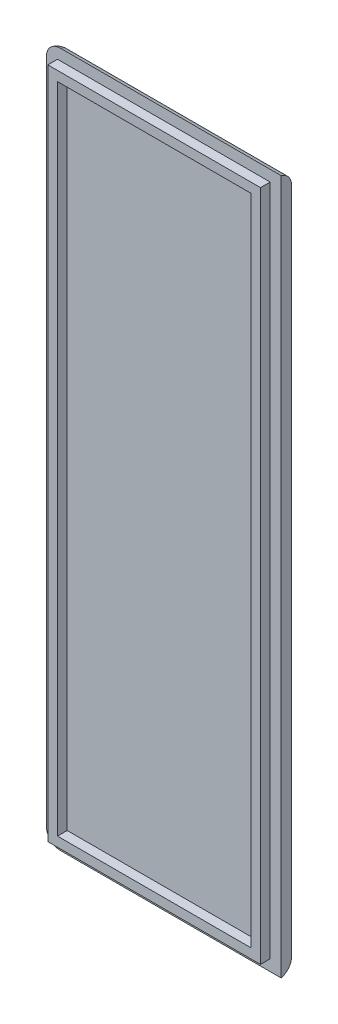
ISO-10303-21;
HEADER;
FILE_DESCRIPTION(('STEP AP214'),'2;1');
FILE_NAME('part.step','',(''),(''),'','','');
FILE_SCHEMA(('AUTOMOTIVE_DESIGN { 1 0 10303 214 1 1 1 1 }'));
ENDSEC;
DATA;
#1=APPLICATION_CONTEXT('core data for automotive mechanical design processes');
#2=APPLICATION_PROTOCOL_DEFINITION('international standard','automotive_design',2000,#1);
#3=PRODUCT_CONTEXT('',#1,'mechanical');
#4=PRODUCT('Part','Part','',(#3));
#5=PRODUCT_RELATED_PRODUCT_CATEGORY('part','',(#4));
#6=PRODUCT_DEFINITION_FORMATION('','',#4);
#7=PRODUCT_DEFINITION_CONTEXT('part definition',#1,'design');
#8=PRODUCT_DEFINITION('design','',#6,#7);
#9=PRODUCT_DEFINITION_SHAPE('','',#8);
#10=(LENGTH_UNIT() NAMED_UNIT(*) SI_UNIT(.MILLI.,.METRE.));
#11=(NAMED_UNIT(*) PLANE_ANGLE_UNIT() SI_UNIT($,.RADIAN.));
#12=(NAMED_UNIT(*) SI_UNIT($,.STERADIAN.) SOLID_ANGLE_UNIT());
#13=UNCERTAINTY_MEASURE_WITH_UNIT(LENGTH_MEASURE(1.E-05),#10,'distance_accuracy_value','');
#14=(GEOMETRIC_REPRESENTATION_CONTEXT(3) GLOBAL_UNCERTAINTY_ASSIGNED_CONTEXT((#13)) GLOBAL_UNIT_ASSIGNED_CONTEXT((#10,
#11,#12)) REPRESENTATION_CONTEXT('',''));
#15=CARTESIAN_POINT('',(0.,0.,0.));
#16=DIRECTION('',(0.,0.,1.));
#17=DIRECTION('',(1.,0.,0.));
#18=AXIS2_PLACEMENT_3D('',#15,#16,#17);
#19=CARTESIAN_POINT('',(0.,0.,1.5));
#20=DIRECTION('',(0.,0.,-1.));
#21=DIRECTION('',(-1.,0.,0.));
#22=AXIS2_PLACEMENT_3D('',#19,#20,#21);
#23=PLANE('',#22);
#24=DIRECTION('',(-1.,0.,0.));
#25=VECTOR('',#24,1.);
#26=CARTESIAN_POINT('',(0.,100.65,1.5));
#27=LINE('',#26,#25);
#28=CARTESIAN_POINT('',(34.,100.65,1.5));
#29=VERTEX_POINT('',#28);
#30=CARTESIAN_POINT('',(1.99999999999998,100.65,1.5));
#31=VERTEX_POINT('',#30);
#32=EDGE_CURVE('E219',#29,#31,#27,.T.);
#33=ORIENTED_EDGE('',*,*,#32,.T.);
#34=CARTESIAN_POINT('',(1.99999999999998,98.65,1.5));
#35=DIRECTION('',(0.,0.,-1.));
#36=DIRECTION('',(-1.,0.,0.));
#37=AXIS2_PLACEMENT_3D('',#34,#35,#36);
#38=CIRCLE('',#37,2.);
#39=CARTESIAN_POINT('',(0.,98.65,1.5));
#40=VERTEX_POINT('',#39);
#41=EDGE_CURVE('E226',#31,#40,#38,.F.);
#42=ORIENTED_EDGE('',*,*,#41,.T.);
#43=DIRECTION('',(0.,-1.,0.));
#44=VECTOR('',#43,1.);
#45=CARTESIAN_POINT('',(0.,0.,1.5));
#46=LINE('',#45,#44);
#47=CARTESIAN_POINT('',(0.,2.,1.5));
#48=VERTEX_POINT('',#47);
#49=EDGE_CURVE('E212',#40,#48,#46,.T.);
#50=ORIENTED_EDGE('',*,*,#49,.T.);
#51=CARTESIAN_POINT('',(2.,2.,1.5));
#52=DIRECTION('',(0.,0.,-1.));
#53=DIRECTION('',(-1.,0.,0.));
#54=AXIS2_PLACEMENT_3D('',#51,#52,#53);
#55=CIRCLE('',#54,2.);
#56=CARTESIAN_POINT('',(2.,0.,1.5));
#57=VERTEX_POINT('',#56);
#58=EDGE_CURVE('E222',#48,#57,#55,.F.);
#59=ORIENTED_EDGE('',*,*,#58,.T.);
#60=DIRECTION('',(1.,0.,0.));
#61=VECTOR('',#60,1.);
#62=CARTESIAN_POINT('',(0.,0.,1.5));
#63=LINE('',#62,#61);
#64=CARTESIAN_POINT('',(34.,0.,1.5));
#65=VERTEX_POINT('',#64);
#66=EDGE_CURVE('E214',#57,#65,#63,.T.);
#67=ORIENTED_EDGE('',*,*,#66,.T.);
#68=DIRECTION('',(0.,1.,0.));
#69=VECTOR('',#68,1.);
#70=CARTESIAN_POINT('',(34.,0.,1.5));
#71=LINE('',#70,#69);
#72=EDGE_CURVE('E216',#65,#29,#71,.T.);
#73=ORIENTED_EDGE('',*,*,#72,.T.);
#74=EDGE_LOOP('',(#33,#42,#50,#59,#67,#73));
#75=FACE_BOUND('',#74,.T.);
#76=DIRECTION('',(0.,-1.,0.));
#77=VECTOR('',#76,1.);
#78=CARTESIAN_POINT('',(1.59999999999998,99.05,1.5));
#79=LINE('',#78,#77);
#80=CARTESIAN_POINT('',(1.59999999999998,99.05,1.5));
#81=VERTEX_POINT('',#80);
#82=CARTESIAN_POINT('',(1.59999999999999,1.6,1.5));
#83=VERTEX_POINT('',#82);
#84=EDGE_CURVE('E155',#81,#83,#79,.T.);
#85=ORIENTED_EDGE('',*,*,#84,.F.);
#86=DIRECTION('',(-1.,0.,0.));
#87=VECTOR('',#86,1.);
#88=CARTESIAN_POINT('',(1.59999999999998,99.05,1.5));
#89=LINE('',#88,#87);
#90=CARTESIAN_POINT('',(32.4,99.05,1.5));
#91=VERTEX_POINT('',#90);
#92=EDGE_CURVE('E183',#91,#81,#89,.T.);
#93=ORIENTED_EDGE('',*,*,#92,.F.);
#94=DIRECTION('',(0.,1.,0.));
#95=VECTOR('',#94,1.);
#96=CARTESIAN_POINT('',(32.4,99.05,1.5));
#97=LINE('',#96,#95);
#98=CARTESIAN_POINT('',(32.4,1.6,1.5));
#99=VERTEX_POINT('',#98);
#100=EDGE_CURVE('E195',#99,#91,#97,.T.);
#101=ORIENTED_EDGE('',*,*,#100,.F.);
#102=DIRECTION('',(1.,0.,0.));
#103=VECTOR('',#102,1.);
#104=CARTESIAN_POINT('',(1.59999999999999,1.6,1.5));
#105=LINE('',#104,#103);
#106=EDGE_CURVE('E192',#83,#99,#105,.T.);
#107=ORIENTED_EDGE('',*,*,#106,.F.);
#108=EDGE_LOOP('',(#85,#93,#101,#107));
#109=FACE_BOUND('',#108,.T.);
#110=ADVANCED_FACE('F35',(#75,#109),#23,.F.);
#111=CARTESIAN_POINT('',(34.,0.,1.5));
#112=DIRECTION('',(-1.,0.,0.));
#113=DIRECTION('',(0.,-1.,0.));
#114=AXIS2_PLACEMENT_3D('',#111,#112,#113);
#115=PLANE('',#114);
#116=DIRECTION('',(0.,1.,0.));
#117=VECTOR('',#116,1.);
#118=CARTESIAN_POINT('',(34.,0.,0.));
#119=LINE('',#118,#117);
#120=CARTESIAN_POINT('',(34.,1.93649167310371,0.));
#121=VERTEX_POINT('',#120);
#122=CARTESIAN_POINT('',(34.,98.7135083268963,0.));
#123=VERTEX_POINT('',#122);
#124=EDGE_CURVE('E211',#121,#123,#119,.T.);
#125=ORIENTED_EDGE('',*,*,#124,.T.);
#126=CARTESIAN_POINT('',(34.,98.7135083268963,2.));
#127=DIRECTION('',(-1.,0.,0.));
#128=DIRECTION('',(0.,-1.,0.));
#129=AXIS2_PLACEMENT_3D('',#126,#127,#128);
#130=CIRCLE('',#129,2.);
#131=EDGE_CURVE('E11',#123,#29,#130,.F.);
#132=ORIENTED_EDGE('',*,*,#131,.T.);
#133=ORIENTED_EDGE('',*,*,#72,.F.);
#134=CARTESIAN_POINT('',(34.,1.93649167310371,2.));
#135=DIRECTION('',(-1.,0.,0.));
#136=DIRECTION('',(0.,-1.,0.));
#137=AXIS2_PLACEMENT_3D('',#134,#135,#136);
#138=CIRCLE('',#137,2.);
#139=EDGE_CURVE('E44',#65,#121,#138,.F.);
#140=ORIENTED_EDGE('',*,*,#139,.T.);
#141=EDGE_LOOP('',(#125,#132,#133,#140));
#142=FACE_BOUND('',#141,.T.);
#143=ADVANCED_FACE('F261',(#142),#115,.F.);
#144=CARTESIAN_POINT('',(0.,0.,0.));
#145=DIRECTION('',(0.,0.,-1.));
#146=DIRECTION('',(-1.,0.,0.));
#147=AXIS2_PLACEMENT_3D('',#144,#145,#146);
#148=PLANE('',#147);
#149=CARTESIAN_POINT('',(1.99999999999998,98.65,0.));
#150=DIRECTION('',(0.,0.,-1.));
#151=DIRECTION('',(-1.,0.,0.));
#152=AXIS2_PLACEMENT_3D('',#149,#150,#151);
#153=CIRCLE('',#152,0.0635083268962916);
#154=CARTESIAN_POINT('',(1.93649167310369,98.65,0.));
#155=VERTEX_POINT('',#154);
#156=CARTESIAN_POINT('',(1.99999999999998,98.7135083268963,0.));
#157=VERTEX_POINT('',#156);
#158=EDGE_CURVE('E52',#155,#157,#153,.T.);
#159=ORIENTED_EDGE('',*,*,#158,.T.);
#160=DIRECTION('',(-1.,0.,0.));
#161=VECTOR('',#160,1.);
#162=CARTESIAN_POINT('',(34.,98.7135083268963,0.));
#163=LINE('',#162,#161);
#164=EDGE_CURVE('E234',#157,#123,#163,.F.);
#165=ORIENTED_EDGE('',*,*,#164,.T.);
#166=ORIENTED_EDGE('',*,*,#124,.F.);
#167=DIRECTION('',(1.,0.,0.));
#168=VECTOR('',#167,1.);
#169=CARTESIAN_POINT('',(2.,1.93649167310371,0.));
#170=LINE('',#169,#168);
#171=CARTESIAN_POINT('',(2.,1.93649167310371,0.));
#172=VERTEX_POINT('',#171);
#173=EDGE_CURVE('E228',#121,#172,#170,.F.);
#174=ORIENTED_EDGE('',*,*,#173,.T.);
#175=CARTESIAN_POINT('',(2.,2.,0.));
#176=DIRECTION('',(0.,0.,-1.));
#177=DIRECTION('',(-1.,0.,0.));
#178=AXIS2_PLACEMENT_3D('',#175,#176,#177);
#179=CIRCLE('',#178,0.0635083268962916);
#180=CARTESIAN_POINT('',(1.93649167310371,2.,0.));
#181=VERTEX_POINT('',#180);
#182=EDGE_CURVE('E230',#172,#181,#179,.T.);
#183=ORIENTED_EDGE('',*,*,#182,.T.);
#184=DIRECTION('',(0.,-1.,0.));
#185=VECTOR('',#184,1.);
#186=CARTESIAN_POINT('',(1.93649167310369,98.65,0.));
#187=LINE('',#186,#185);
#188=EDGE_CURVE('E57',#181,#155,#187,.F.);
#189=ORIENTED_EDGE('',*,*,#188,.T.);
#190=EDGE_LOOP('',(#159,#165,#166,#174,#183,#189));
#191=FACE_BOUND('',#190,.T.);
#192=ADVANCED_FACE('F285',(#191),#148,.T.);
#193=CARTESIAN_POINT('',(0.,0.,2.9));
#194=DIRECTION('',(0.,0.,1.));
#195=DIRECTION('',(1.,0.,0.));
#196=AXIS2_PLACEMENT_3D('',#193,#194,#195);
#197=PLANE('',#196);
#198=DIRECTION('',(0.,-1.,0.));
#199=VECTOR('',#198,1.);
#200=CARTESIAN_POINT('',(1.59999999999998,99.05,2.9));
#201=LINE('',#200,#199);
#202=CARTESIAN_POINT('',(1.59999999999998,99.05,2.9));
#203=VERTEX_POINT('',#202);
#204=CARTESIAN_POINT('',(1.59999999999999,1.6,2.9));
#205=VERTEX_POINT('',#204);
#206=EDGE_CURVE('E179',#203,#205,#201,.T.);
#207=ORIENTED_EDGE('',*,*,#206,.T.);
#208=DIRECTION('',(1.,0.,0.));
#209=VECTOR('',#208,1.);
#210=CARTESIAN_POINT('',(1.59999999999999,1.6,2.9));
#211=LINE('',#210,#209);
#212=CARTESIAN_POINT('',(32.4,1.6,2.9));
#213=VERTEX_POINT('',#212);
#214=EDGE_CURVE('E182',#205,#213,#211,.T.);
#215=ORIENTED_EDGE('',*,*,#214,.T.);
#216=DIRECTION('',(0.,1.,0.));
#217=VECTOR('',#216,1.);
#218=CARTESIAN_POINT('',(32.4,99.05,2.9));
#219=LINE('',#218,#217);
#220=CARTESIAN_POINT('',(32.4,99.05,2.9));
#221=VERTEX_POINT('',#220);
#222=EDGE_CURVE('E185',#213,#221,#219,.T.);
#223=ORIENTED_EDGE('',*,*,#222,.T.);
#224=DIRECTION('',(-1.,0.,0.));
#225=VECTOR('',#224,1.);
#226=CARTESIAN_POINT('',(1.59999999999998,99.05,2.9));
#227=LINE('',#226,#225);
#228=EDGE_CURVE('E187',#221,#203,#227,.T.);
#229=ORIENTED_EDGE('',*,*,#228,.T.);
#230=EDGE_LOOP('',(#207,#215,#223,#229));
#231=FACE_BOUND('',#230,.T.);
#232=DIRECTION('',(1.,0.,0.));
#233=VECTOR('',#232,1.);
#234=CARTESIAN_POINT('',(2.99999999999999,3.,2.9));
#235=LINE('',#234,#233);
#236=CARTESIAN_POINT('',(2.99999999999999,3.,2.9));
#237=VERTEX_POINT('',#236);
#238=CARTESIAN_POINT('',(31.,3.,2.9));
#239=VERTEX_POINT('',#238);
#240=EDGE_CURVE('E147',#237,#239,#235,.T.);
#241=ORIENTED_EDGE('',*,*,#240,.F.);
#242=DIRECTION('',(0.,-1.,0.));
#243=VECTOR('',#242,1.);
#244=CARTESIAN_POINT('',(2.99999999999998,97.65,2.9));
#245=LINE('',#244,#243);
#246=CARTESIAN_POINT('',(2.99999999999998,97.65,2.9));
#247=VERTEX_POINT('',#246);
#248=EDGE_CURVE('E137',#247,#237,#245,.T.);
#249=ORIENTED_EDGE('',*,*,#248,.F.);
#250=DIRECTION('',(-1.,0.,0.));
#251=VECTOR('',#250,1.);
#252=CARTESIAN_POINT('',(2.99999999999998,97.65,2.9));
#253=LINE('',#252,#251);
#254=CARTESIAN_POINT('',(31.,97.65,2.9));
#255=VERTEX_POINT('',#254);
#256=EDGE_CURVE('E163',#255,#247,#253,.T.);
#257=ORIENTED_EDGE('',*,*,#256,.F.);
#258=DIRECTION('',(0.,1.,0.));
#259=VECTOR('',#258,1.);
#260=CARTESIAN_POINT('',(31.,97.65,2.9));
#261=LINE('',#260,#259);
#262=EDGE_CURVE('E161',#239,#255,#261,.T.);
#263=ORIENTED_EDGE('',*,*,#262,.F.);
#264=EDGE_LOOP('',(#241,#249,#257,#263));
#265=FACE_BOUND('',#264,.T.);
#266=ADVANCED_FACE('F159',(#231,#265),#197,.T.);
#267=CARTESIAN_POINT('',(1.59999999999998,99.05,2.9));
#268=DIRECTION('',(1.,0.,0.));
#269=DIRECTION('',(0.,1.,0.));
#270=AXIS2_PLACEMENT_3D('',#267,#268,#269);
#271=PLANE('',#270);
#272=ORIENTED_EDGE('',*,*,#84,.T.);
#273=DIRECTION('',(0.,0.,-1.));
#274=VECTOR('',#273,1.);
#275=CARTESIAN_POINT('',(1.59999999999999,1.6,2.9));
#276=LINE('',#275,#274);
#277=EDGE_CURVE('E208',#205,#83,#276,.T.);
#278=ORIENTED_EDGE('',*,*,#277,.F.);
#279=ORIENTED_EDGE('',*,*,#206,.F.);
#280=DIRECTION('',(0.,0.,-1.));
#281=VECTOR('',#280,1.);
#282=CARTESIAN_POINT('',(1.59999999999998,99.05,2.9));
#283=LINE('',#282,#281);
#284=EDGE_CURVE('E189',#203,#81,#283,.T.);
#285=ORIENTED_EDGE('',*,*,#284,.T.);
#286=EDGE_LOOP('',(#272,#278,#279,#285));
#287=FACE_BOUND('',#286,.T.);
#288=ADVANCED_FACE('F314',(#287),#271,.F.);
#289=CARTESIAN_POINT('',(1.59999999999999,1.6,2.9));
#290=DIRECTION('',(0.,1.,0.));
#291=DIRECTION('',(0.,0.,1.));
#292=AXIS2_PLACEMENT_3D('',#289,#290,#291);
#293=PLANE('',#292);
#294=ORIENTED_EDGE('',*,*,#106,.T.);
#295=DIRECTION('',(0.,0.,-1.));
#296=VECTOR('',#295,1.);
#297=CARTESIAN_POINT('',(32.4,1.6,2.9));
#298=LINE('',#297,#296);
#299=EDGE_CURVE('E205',#213,#99,#298,.T.);
#300=ORIENTED_EDGE('',*,*,#299,.F.);
#301=ORIENTED_EDGE('',*,*,#214,.F.);
#302=ORIENTED_EDGE('',*,*,#277,.T.);
#303=EDGE_LOOP('',(#294,#300,#301,#302));
#304=FACE_BOUND('',#303,.T.);
#305=ADVANCED_FACE('F322',(#304),#293,.F.);
#306=CARTESIAN_POINT('',(32.4,99.05,2.9));
#307=DIRECTION('',(-1.,0.,0.));
#308=DIRECTION('',(0.,-1.,0.));
#309=AXIS2_PLACEMENT_3D('',#306,#307,#308);
#310=PLANE('',#309);
#311=ORIENTED_EDGE('',*,*,#100,.T.);
#312=DIRECTION('',(0.,0.,-1.));
#313=VECTOR('',#312,1.);
#314=CARTESIAN_POINT('',(32.4,99.05,2.9));
#315=LINE('',#314,#313);
#316=EDGE_CURVE('E202',#221,#91,#315,.T.);
#317=ORIENTED_EDGE('',*,*,#316,.F.);
#318=ORIENTED_EDGE('',*,*,#222,.F.);
#319=ORIENTED_EDGE('',*,*,#299,.T.);
#320=EDGE_LOOP('',(#311,#317,#318,#319));
#321=FACE_BOUND('',#320,.T.);
#322=ADVANCED_FACE('F318',(#321),#310,.F.);
#323=CARTESIAN_POINT('',(1.59999999999998,99.05,2.9));
#324=DIRECTION('',(0.,-1.,0.));
#325=DIRECTION('',(0.,0.,-1.));
#326=AXIS2_PLACEMENT_3D('',#323,#324,#325);
#327=PLANE('',#326);
#328=ORIENTED_EDGE('',*,*,#92,.T.);
#329=ORIENTED_EDGE('',*,*,#284,.F.);
#330=ORIENTED_EDGE('',*,*,#228,.F.);
#331=ORIENTED_EDGE('',*,*,#316,.T.);
#332=EDGE_LOOP('',(#328,#329,#330,#331));
#333=FACE_BOUND('',#332,.T.);
#334=ADVANCED_FACE('F311',(#333),#327,.F.);
#335=CARTESIAN_POINT('',(2.99999999999998,97.65,2.9));
#336=DIRECTION('',(1.,0.,0.));
#337=DIRECTION('',(0.,1.,0.));
#338=AXIS2_PLACEMENT_3D('',#335,#336,#337);
#339=PLANE('',#338);
#340=DIRECTION('',(0.,-1.,0.));
#341=VECTOR('',#340,1.);
#342=CARTESIAN_POINT('',(2.99999999999998,97.65,1.5));
#343=LINE('',#342,#341);
#344=CARTESIAN_POINT('',(2.99999999999998,97.65,1.5));
#345=VERTEX_POINT('',#344);
#346=CARTESIAN_POINT('',(2.99999999999999,3.,1.5));
#347=VERTEX_POINT('',#346);
#348=EDGE_CURVE('E167',#345,#347,#343,.T.);
#349=ORIENTED_EDGE('',*,*,#348,.F.);
#350=DIRECTION('',(0.,0.,-1.));
#351=VECTOR('',#350,1.);
#352=CARTESIAN_POINT('',(2.99999999999998,97.65,2.9));
#353=LINE('',#352,#351);
#354=EDGE_CURVE('E143',#247,#345,#353,.T.);
#355=ORIENTED_EDGE('',*,*,#354,.F.);
#356=ORIENTED_EDGE('',*,*,#248,.T.);
#357=DIRECTION('',(0.,0.,-1.));
#358=VECTOR('',#357,1.);
#359=CARTESIAN_POINT('',(2.99999999999999,3.,2.9));
#360=LINE('',#359,#358);
#361=EDGE_CURVE('E141',#237,#347,#360,.T.);
#362=ORIENTED_EDGE('',*,*,#361,.T.);
#363=EDGE_LOOP('',(#349,#355,#356,#362));
#364=FACE_BOUND('',#363,.T.);
#365=ADVANCED_FACE('F140',(#364),#339,.T.);
#366=CARTESIAN_POINT('',(2.99999999999999,3.,2.9));
#367=DIRECTION('',(0.,1.,0.));
#368=DIRECTION('',(0.,0.,1.));
#369=AXIS2_PLACEMENT_3D('',#366,#367,#368);
#370=PLANE('',#369);
#371=DIRECTION('',(1.,0.,0.));
#372=VECTOR('',#371,1.);
#373=CARTESIAN_POINT('',(2.99999999999999,3.,1.5));
#374=LINE('',#373,#372);
#375=CARTESIAN_POINT('',(31.,3.,1.5));
#376=VERTEX_POINT('',#375);
#377=EDGE_CURVE('E154',#347,#376,#374,.T.);
#378=ORIENTED_EDGE('',*,*,#377,.F.);
#379=ORIENTED_EDGE('',*,*,#361,.F.);
#380=ORIENTED_EDGE('',*,*,#240,.T.);
#381=DIRECTION('',(0.,0.,-1.));
#382=VECTOR('',#381,1.);
#383=CARTESIAN_POINT('',(31.,3.,2.9));
#384=LINE('',#383,#382);
#385=EDGE_CURVE('E156',#239,#376,#384,.T.);
#386=ORIENTED_EDGE('',*,*,#385,.T.);
#387=EDGE_LOOP('',(#378,#379,#380,#386));
#388=FACE_BOUND('',#387,.T.);
#389=ADVANCED_FACE('F151',(#388),#370,.T.);
#390=CARTESIAN_POINT('',(31.,97.65,2.9));
#391=DIRECTION('',(-1.,0.,0.));
#392=DIRECTION('',(0.,-1.,0.));
#393=AXIS2_PLACEMENT_3D('',#390,#391,#392);
#394=PLANE('',#393);
#395=DIRECTION('',(0.,1.,0.));
#396=VECTOR('',#395,1.);
#397=CARTESIAN_POINT('',(31.,97.65,1.5));
#398=LINE('',#397,#396);
#399=CARTESIAN_POINT('',(31.,97.65,1.5));
#400=VERTEX_POINT('',#399);
#401=EDGE_CURVE('E170',#376,#400,#398,.T.);
#402=ORIENTED_EDGE('',*,*,#401,.F.);
#403=ORIENTED_EDGE('',*,*,#385,.F.);
#404=ORIENTED_EDGE('',*,*,#262,.T.);
#405=DIRECTION('',(0.,0.,-1.));
#406=VECTOR('',#405,1.);
#407=CARTESIAN_POINT('',(31.,97.65,2.9));
#408=LINE('',#407,#406);
#409=EDGE_CURVE('E176',#255,#400,#408,.T.);
#410=ORIENTED_EDGE('',*,*,#409,.T.);
#411=EDGE_LOOP('',(#402,#403,#404,#410));
#412=FACE_BOUND('',#411,.T.);
#413=ADVANCED_FACE('F296',(#412),#394,.T.);
#414=CARTESIAN_POINT('',(2.99999999999998,97.65,2.9));
#415=DIRECTION('',(0.,-1.,0.));
#416=DIRECTION('',(0.,0.,-1.));
#417=AXIS2_PLACEMENT_3D('',#414,#415,#416);
#418=PLANE('',#417);
#419=DIRECTION('',(-1.,0.,0.));
#420=VECTOR('',#419,1.);
#421=CARTESIAN_POINT('',(2.99999999999998,97.65,1.5));
#422=LINE('',#421,#420);
#423=EDGE_CURVE('E148',#400,#345,#422,.T.);
#424=ORIENTED_EDGE('',*,*,#423,.F.);
#425=ORIENTED_EDGE('',*,*,#409,.F.);
#426=ORIENTED_EDGE('',*,*,#256,.T.);
#427=ORIENTED_EDGE('',*,*,#354,.T.);
#428=EDGE_LOOP('',(#424,#425,#426,#427));
#429=FACE_BOUND('',#428,.T.);
#430=ADVANCED_FACE('F290',(#429),#418,.T.);
#431=ORIENTED_EDGE('',*,*,#423,.T.);
#432=ORIENTED_EDGE('',*,*,#348,.T.);
#433=ORIENTED_EDGE('',*,*,#377,.T.);
#434=ORIENTED_EDGE('',*,*,#401,.T.);
#435=EDGE_LOOP('',(#431,#432,#433,#434));
#436=FACE_BOUND('',#435,.T.);
#437=ADVANCED_FACE('F281',(#436),#23,.F.);
#438=CARTESIAN_POINT('',(0.,1.93649167310371,2.));
#439=DIRECTION('',(-1.,0.,0.));
#440=DIRECTION('',(0.,0.,1.));
#441=AXIS2_PLACEMENT_3D('',#438,#439,#440);
#442=CYLINDRICAL_SURFACE('',#441,2.);
#443=ORIENTED_EDGE('',*,*,#139,.F.);
#444=ORIENTED_EDGE('',*,*,#66,.F.);
#445=CARTESIAN_POINT('',(2.,1.93649167310371,2.));
#446=DIRECTION('',(-1.,0.,0.));
#447=DIRECTION('',(0.,0.,1.));
#448=AXIS2_PLACEMENT_3D('',#445,#446,#447);
#449=CIRCLE('',#448,2.);
#450=EDGE_CURVE('E39',#172,#57,#449,.T.);
#451=ORIENTED_EDGE('',*,*,#450,.F.);
#452=ORIENTED_EDGE('',*,*,#173,.F.);
#453=EDGE_LOOP('',(#443,#444,#451,#452));
#454=FACE_BOUND('',#453,.T.);
#455=ADVANCED_FACE('F37',(#454),#442,.T.);
#456=CARTESIAN_POINT('',(2.,2.,2.));
#457=DIRECTION('',(0.,0.,1.));
#458=DIRECTION('',(1.,0.,0.));
#459=AXIS2_PLACEMENT_3D('',#456,#457,#458);
#460=DEGENERATE_TOROIDAL_SURFACE('',#459,0.0635083268962916,2.,.T.);
#461=ORIENTED_EDGE('',*,*,#450,.T.);
#462=ORIENTED_EDGE('',*,*,#58,.F.);
#463=CARTESIAN_POINT('',(1.93649167310371,2.,2.));
#464=DIRECTION('',(0.,1.,0.));
#465=DIRECTION('',(-1.,0.,0.));
#466=AXIS2_PLACEMENT_3D('',#463,#464,#465);
#467=CIRCLE('',#466,2.);
#468=EDGE_CURVE('E241',#181,#48,#467,.T.);
#469=ORIENTED_EDGE('',*,*,#468,.F.);
#470=ORIENTED_EDGE('',*,*,#182,.F.);
#471=EDGE_LOOP('',(#461,#462,#469,#470));
#472=FACE_BOUND('',#471,.T.);
#473=ADVANCED_FACE('F251',(#472),#460,.T.);
#474=CARTESIAN_POINT('',(1.93649167310371,0.,2.));
#475=DIRECTION('',(0.,1.,0.));
#476=DIRECTION('',(-1.,0.,0.));
#477=AXIS2_PLACEMENT_3D('',#474,#475,#476);
#478=CYLINDRICAL_SURFACE('',#477,2.);
#479=ORIENTED_EDGE('',*,*,#468,.T.);
#480=ORIENTED_EDGE('',*,*,#49,.F.);
#481=CARTESIAN_POINT('',(1.93649167310369,98.65,2.));
#482=DIRECTION('',(0.,1.,0.));
#483=DIRECTION('',(0.,0.,1.));
#484=AXIS2_PLACEMENT_3D('',#481,#482,#483);
#485=CIRCLE('',#484,2.);
#486=EDGE_CURVE('E239',#155,#40,#485,.T.);
#487=ORIENTED_EDGE('',*,*,#486,.F.);
#488=ORIENTED_EDGE('',*,*,#188,.F.);
#489=EDGE_LOOP('',(#479,#480,#487,#488));
#490=FACE_BOUND('',#489,.T.);
#491=ADVANCED_FACE('F269',(#490),#478,.T.);
#492=CARTESIAN_POINT('',(1.99999999999998,98.65,2.));
#493=DIRECTION('',(0.,0.,1.));
#494=DIRECTION('',(1.,0.,0.));
#495=AXIS2_PLACEMENT_3D('',#492,#493,#494);
#496=DEGENERATE_TOROIDAL_SURFACE('',#495,0.0635083268962916,2.,.T.);
#497=ORIENTED_EDGE('',*,*,#486,.T.);
#498=ORIENTED_EDGE('',*,*,#41,.F.);
#499=CARTESIAN_POINT('',(1.99999999999998,98.7135083268963,2.));
#500=DIRECTION('',(1.,0.,0.));
#501=DIRECTION('',(0.,0.,-1.));
#502=AXIS2_PLACEMENT_3D('',#499,#500,#501);
#503=CIRCLE('',#502,2.);
#504=EDGE_CURVE('E237',#157,#31,#503,.T.);
#505=ORIENTED_EDGE('',*,*,#504,.F.);
#506=ORIENTED_EDGE('',*,*,#158,.F.);
#507=EDGE_LOOP('',(#497,#498,#505,#506));
#508=FACE_BOUND('',#507,.T.);
#509=ADVANCED_FACE('F270',(#508),#496,.T.);
#510=CARTESIAN_POINT('',(0.,98.7135083268963,2.));
#511=DIRECTION('',(1.,0.,0.));
#512=DIRECTION('',(0.,0.,-1.));
#513=AXIS2_PLACEMENT_3D('',#510,#511,#512);
#514=CYLINDRICAL_SURFACE('',#513,2.);
#515=ORIENTED_EDGE('',*,*,#131,.F.);
#516=ORIENTED_EDGE('',*,*,#164,.F.);
#517=ORIENTED_EDGE('',*,*,#504,.T.);
#518=ORIENTED_EDGE('',*,*,#32,.F.);
#519=EDGE_LOOP('',(#515,#516,#517,#518));
#520=FACE_BOUND('',#519,.T.);
#521=ADVANCED_FACE('F265',(#520),#514,.T.);
#522=CLOSED_SHELL('',(#110,#143,#192,#266,#288,#305,#322,#334,#365,#389,#413,#430,#437,#455,
#473,#491,#509,#521));
#523=MANIFOLD_SOLID_BREP('B2',#522);
#524=ADVANCED_BREP_SHAPE_REPRESENTATION('',(#18,#523),#14);
#525=SHAPE_DEFINITION_REPRESENTATION(#9,#524);
ENDSEC;
END-ISO-10303-21;
